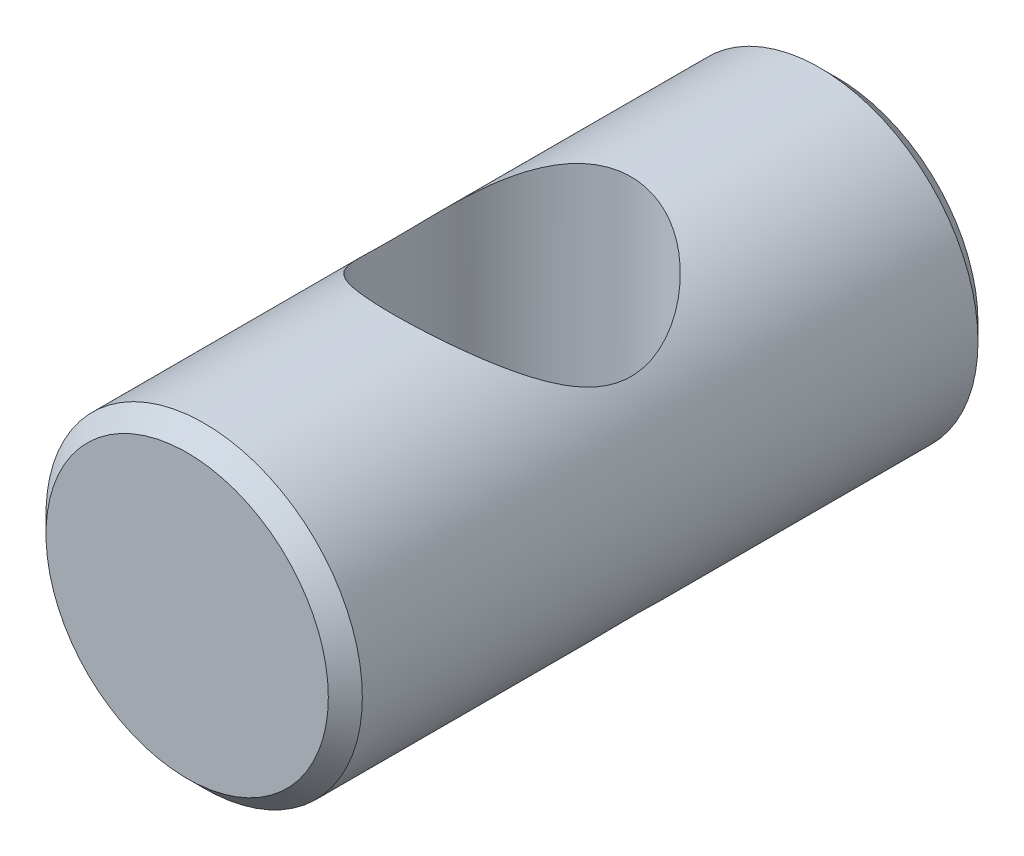
ISO-10303-21;
HEADER;
FILE_DESCRIPTION(('STEP AP214'),'2;1');
FILE_NAME('part.step','',(''),(''),'','','');
FILE_SCHEMA(('AUTOMOTIVE_DESIGN { 1 0 10303 214 1 1 1 1 }'));
ENDSEC;
DATA;
#1=APPLICATION_CONTEXT('core data for automotive mechanical design processes');
#2=APPLICATION_PROTOCOL_DEFINITION('international standard','automotive_design',2000,#1);
#3=PRODUCT_CONTEXT('',#1,'mechanical');
#4=PRODUCT('Part','Part','',(#3));
#5=PRODUCT_RELATED_PRODUCT_CATEGORY('part','',(#4));
#6=PRODUCT_DEFINITION_FORMATION('','',#4);
#7=PRODUCT_DEFINITION_CONTEXT('part definition',#1,'design');
#8=PRODUCT_DEFINITION('design','',#6,#7);
#9=PRODUCT_DEFINITION_SHAPE('','',#8);
#10=(LENGTH_UNIT() NAMED_UNIT(*) SI_UNIT(.MILLI.,.METRE.));
#11=(NAMED_UNIT(*) PLANE_ANGLE_UNIT() SI_UNIT($,.RADIAN.));
#12=(NAMED_UNIT(*) SI_UNIT($,.STERADIAN.) SOLID_ANGLE_UNIT());
#13=UNCERTAINTY_MEASURE_WITH_UNIT(LENGTH_MEASURE(1.E-05),#10,'distance_accuracy_value','');
#14=(GEOMETRIC_REPRESENTATION_CONTEXT(3) GLOBAL_UNCERTAINTY_ASSIGNED_CONTEXT((#13)) GLOBAL_UNIT_ASSIGNED_CONTEXT((#10,
#11,#12)) REPRESENTATION_CONTEXT('',''));
#15=CARTESIAN_POINT('',(0.,0.,0.));
#16=DIRECTION('',(0.,0.,1.));
#17=DIRECTION('',(1.,0.,0.));
#18=AXIS2_PLACEMENT_3D('',#15,#16,#17);
#19=CARTESIAN_POINT('',(0.,0.,19.1));
#20=DIRECTION('',(0.,0.,-1.));
#21=DIRECTION('',(-1.,0.,0.));
#22=AXIS2_PLACEMENT_3D('',#19,#20,#21);
#23=CYLINDRICAL_SURFACE('',#22,4.65);
#24=CARTESIAN_POINT('',(0.,0.,18.6));
#25=DIRECTION('',(0.,0.,1.));
#26=DIRECTION('',(1.,0.,0.));
#27=AXIS2_PLACEMENT_3D('',#24,#25,#26);
#28=CIRCLE('',#27,4.65);
#29=CARTESIAN_POINT('',(4.65,0.,18.6));
#30=VERTEX_POINT('',#29);
#31=EDGE_CURVE('E45',#30,#30,#28,.F.);
#32=ORIENTED_EDGE('',*,*,#31,.T.);
#33=EDGE_LOOP('',(#32));
#34=FACE_BOUND('',#33,.T.);
#35=CARTESIAN_POINT('',(0.,0.,0.5));
#36=DIRECTION('',(0.,0.,1.));
#37=DIRECTION('',(1.,0.,0.));
#38=AXIS2_PLACEMENT_3D('',#35,#36,#37);
#39=CIRCLE('',#38,4.65);
#40=CARTESIAN_POINT('',(4.65,0.,0.5));
#41=VERTEX_POINT('',#40);
#42=EDGE_CURVE('E49',#41,#41,#39,.T.);
#43=ORIENTED_EDGE('',*,*,#42,.T.);
#44=EDGE_LOOP('',(#43));
#45=FACE_BOUND('',#44,.T.);
#46=CARTESIAN_POINT('',(0.,-4.65,13.05));
#47=CARTESIAN_POINT('',(0.0854016520703311,-4.64999924797641,13.0499992235247));
#48=CARTESIAN_POINT('',(0.170820772460458,-4.64764155039145,13.046868532975));
#49=CARTESIAN_POINT('',(0.340982078542111,-4.63826485929958,13.034396241319));
#50=CARTESIAN_POINT('',(0.425723855316022,-4.63124323784305,13.0250511386165));
#51=CARTESIAN_POINT('',(0.593972794169848,-4.61268551408863,13.0002805330556));
#52=CARTESIAN_POINT('',(0.677477460313941,-4.60114131119855,12.9848441194232));
#53=CARTESIAN_POINT('',(0.842499041169359,-4.57380672404709,12.9481399612644));
#54=CARTESIAN_POINT('',(0.924015053679695,-4.55801445022944,12.9268696217053));
#55=CARTESIAN_POINT('',(1.16370699019391,-4.50498217508343,12.8550600056808));
#56=CARTESIAN_POINT('',(1.31824636646825,-4.46194486598266,12.7963365295862));
#57=CARTESIAN_POINT('',(1.6141581522421,-4.36364314274375,12.6598418583226));
#58=CARTESIAN_POINT('',(1.75553392120851,-4.30838186048991,12.5820755415438));
#59=CARTESIAN_POINT('',(2.03617452327363,-4.1835631431914,12.4020697188544));
#60=CARTESIAN_POINT('',(2.17402683593423,-4.11315505194096,12.298229123799));
#61=CARTESIAN_POINT('',(2.43155067797185,-3.96636571364538,12.0732655343126));
#62=CARTESIAN_POINT('',(2.55119381534968,-3.88997541429698,11.9521161104817));
#63=CARTESIAN_POINT('',(2.72764774450201,-3.76682912370311,11.7455333111796));
#64=CARTESIAN_POINT('',(2.79053748708562,-3.72035645513535,11.6650311703144));
#65=CARTESIAN_POINT('',(2.90928327218524,-3.62825180158832,11.4984701911185));
#66=CARTESIAN_POINT('',(2.96513718107307,-3.58262007519036,11.4124096791138));
#67=CARTESIAN_POINT('',(3.06946641956924,-3.49364725923386,11.2349216270663));
#68=CARTESIAN_POINT('',(3.11794894941074,-3.45030396175154,11.1434994467794));
#69=CARTESIAN_POINT('',(3.20716584536629,-3.36753461331458,10.955320793587));
#70=CARTESIAN_POINT('',(3.24790462993505,-3.32810633468572,10.8585674034828));
#71=CARTESIAN_POINT('',(3.33239084091584,-3.24380084370752,10.6290618745588));
#72=CARTESIAN_POINT('',(3.3731890789737,-3.20099524346764,10.4944125229991));
#73=CARTESIAN_POINT('',(3.43867103601174,-3.13055761417712,10.2175930860669));
#74=CARTESIAN_POINT('',(3.46339183829155,-3.10289069069028,10.0754411311908));
#75=CARTESIAN_POINT('',(3.49515402739039,-3.06708827779856,9.78524284859338));
#76=CARTESIAN_POINT('',(3.50203082792384,-3.05913464613785,9.63715435272738));
#77=CARTESIAN_POINT('',(3.49692091629068,-3.06497136828269,9.34170734496946));
#78=CARTESIAN_POINT('',(3.48492805772283,-3.07876880705249,9.19434908662259));
#79=CARTESIAN_POINT('',(3.44553182705256,-3.12274325250207,8.92129196357231));
#80=CARTESIAN_POINT('',(3.41995655829178,-3.15096464488871,8.79498641136952));
#81=CARTESIAN_POINT('',(3.3561516164104,-3.21883582136206,8.54877953933281));
#82=CARTESIAN_POINT('',(3.31790959148239,-3.25849675565921,8.42888460378578));
#83=CARTESIAN_POINT('',(3.23816402522837,-3.33756484308486,8.21786882721835));
#84=CARTESIAN_POINT('',(3.1985604853101,-3.37567166129069,8.12551729213381));
#85=CARTESIAN_POINT('',(3.11228487452168,-3.45537736848747,7.94574850944857));
#86=CARTESIAN_POINT('',(3.06561151078674,-3.49697689557167,7.85833216837297));
#87=CARTESIAN_POINT('',(2.96544018589683,-3.58231794544439,7.68830105028567));
#88=CARTESIAN_POINT('',(2.91192706911211,-3.62606408793213,7.60569754806298));
#89=CARTESIAN_POINT('',(2.79841672511146,-3.71437007838121,7.4456021972158));
#90=CARTESIAN_POINT('',(2.73842052482599,-3.75892979654434,7.36810954214766));
#91=CARTESIAN_POINT('',(2.54559390106465,-3.8945480589704,7.13952341432994));
#92=CARTESIAN_POINT('',(2.40247992184502,-3.9852620474612,6.9966628013183));
#93=CARTESIAN_POINT('',(2.09072691104426,-4.15728622361754,6.73574065304956));
#94=CARTESIAN_POINT('',(1.92213734327171,-4.23861410721272,6.61763209704629));
#95=CARTESIAN_POINT('',(1.5969629783553,-4.36995441557075,6.43111382069489));
#96=CARTESIAN_POINT('',(1.44463176612027,-4.42297856732596,6.35749294705031));
#97=CARTESIAN_POINT('',(1.20660100721624,-4.49148801420559,6.26344904047757));
#98=CARTESIAN_POINT('',(1.12564578552973,-4.51249078976704,6.23482691161757));
#99=CARTESIAN_POINT('',(0.960987127335568,-4.55039854521022,6.18340961636302));
#100=CARTESIAN_POINT('',(0.877284896989406,-4.56730529695629,6.16061193018846));
#101=CARTESIAN_POINT('',(0.707087652364706,-4.596742061478,6.12104780317633));
#102=CARTESIAN_POINT('',(0.620577459830355,-4.60924136964784,6.10432365061272));
#103=CARTESIAN_POINT('',(0.446025230114126,-4.62939265837211,6.07741365535619));
#104=CARTESIAN_POINT('',(0.357983913910202,-4.63704686012168,6.06722481657933));
#105=CARTESIAN_POINT('',(0.181092322222013,-4.64731616693855,6.05356342163948));
#106=CARTESIAN_POINT('',(0.092242148748726,-4.64993189883574,6.0500900300157));
#107=CARTESIAN_POINT('',(-0.0854396468258861,-4.65006561315637,6.04991327544421));
#108=CARTESIAN_POINT('',(-0.174271269850604,-4.64758401307796,6.05320935804115));
#109=CARTESIAN_POINT('',(-0.42135638661445,-4.63358378715703,6.07182781835951));
#110=CARTESIAN_POINT('',(-0.578820653633082,-4.61646084472533,6.09461231990147));
#111=CARTESIAN_POINT('',(-0.886874739489147,-4.56731490653541,6.1605548081492));
#112=CARTESIAN_POINT('',(-1.03746312595522,-4.53528882159135,6.20371701885894));
#113=CARTESIAN_POINT('',(-1.33348786072812,-4.45740909363284,6.3100384261661));
#114=CARTESIAN_POINT('',(-1.47859157242758,-4.41113508335242,6.3738089595028));
#115=CARTESIAN_POINT('',(-1.75598629343727,-4.30824024068527,6.51833263025347));
#116=CARTESIAN_POINT('',(-1.88827549221869,-4.25161794947006,6.59908816233653));
#117=CARTESIAN_POINT('',(-2.15978963005895,-4.12117739340144,6.79006047646928));
#118=CARTESIAN_POINT('',(-2.29650852269048,-4.04606540692058,6.90294337832486));
#119=CARTESIAN_POINT('',(-2.55041625312467,-3.89101971689652,7.14657936713772));
#120=CARTESIAN_POINT('',(-2.66756164412391,-3.81107580951435,7.27737106589645));
#121=CARTESIAN_POINT('',(-2.83812806503433,-3.68427174491269,7.49915896093782));
#122=CARTESIAN_POINT('',(-2.89819721750233,-3.63706993001462,7.58493533348989));
#123=CARTESIAN_POINT('',(-3.01081957508615,-3.54440070944432,7.76226297326184));
#124=CARTESIAN_POINT('',(-3.06337003112606,-3.49893394259403,7.85381633519241));
#125=CARTESIAN_POINT('',(-3.16042743511376,-3.41151793256683,8.04238198834429));
#126=CARTESIAN_POINT('',(-3.20495390035807,-3.36956029100152,8.13938025990128));
#127=CARTESIAN_POINT('',(-3.28554578390605,-3.29102630857392,8.33890010426214));
#128=CARTESIAN_POINT('',(-3.32161420485557,-3.25444805972634,8.44141970102765));
#129=CARTESIAN_POINT('',(-3.39156597114839,-3.18164693467596,8.67519896460729));
#130=CARTESIAN_POINT('',(-3.42316870046283,-3.14732203048745,8.80776975102154));
#131=CARTESIAN_POINT('',(-3.47082173060896,-3.09470454318805,9.07860088840103));
#132=CARTESIAN_POINT('',(-3.48690753328025,-3.076375371966,9.21684749358931));
#133=CARTESIAN_POINT('',(-3.50239705376025,-3.05873845745109,9.49634297392032));
#134=CARTESIAN_POINT('',(-3.50170711949716,-3.05953749875507,9.63760430286767));
#135=CARTESIAN_POINT('',(-3.48347171990874,-3.08027328850059,9.91767221979013));
#136=CARTESIAN_POINT('',(-3.46590562269941,-3.10023346228282,10.0564755912376));
#137=CARTESIAN_POINT('',(-3.41011549835102,-3.16158566193282,10.3554447174187));
#138=CARTESIAN_POINT('',(-3.36841322957349,-3.20651425167389,10.5142048610965));
#139=CARTESIAN_POINT('',(-3.26541977360625,-3.31132737196491,10.820131794007));
#140=CARTESIAN_POINT('',(-3.20407875632249,-3.3712498616577,10.9672678921262));
#141=CARTESIAN_POINT('',(-3.08641722060199,-3.47860806553951,11.2039220785708));
#142=CARTESIAN_POINT('',(-3.03476848905386,-3.52390573117453,11.2968143673636));
#143=CARTESIAN_POINT('',(-2.92376455803738,-3.61653430611696,11.4768600778424));
#144=CARTESIAN_POINT('',(-2.86440685654283,-3.66386587219599,11.5640116224084));
#145=CARTESIAN_POINT('',(-2.73823146939111,-3.75910144518487,11.7324683061781));
#146=CARTESIAN_POINT('',(-2.67141010978111,-3.80700572355758,11.8137705334197));
#147=CARTESIAN_POINT('',(-2.53045552372525,-3.90211834699336,11.9703082375423));
#148=CARTESIAN_POINT('',(-2.45631864276601,-3.94932633054416,12.0455406477511));
#149=CARTESIAN_POINT('',(-2.30013668802652,-4.04230263088691,12.1902293734299));
#150=CARTESIAN_POINT('',(-2.218021401678,-4.08805236644861,12.2596220460165));
#151=CARTESIAN_POINT('',(-2.04670023837652,-4.17645907297562,12.3912471952224));
#152=CARTESIAN_POINT('',(-1.95749558787579,-4.21911657646269,12.4534809057947));
#153=CARTESIAN_POINT('',(-1.77242441706879,-4.30013789980879,12.5700059758156));
#154=CARTESIAN_POINT('',(-1.67657001149188,-4.33850921181738,12.6243112466654));
#155=CARTESIAN_POINT('',(-1.47864210565636,-4.40989844182112,12.7242595081585));
#156=CARTESIAN_POINT('',(-1.37657179434481,-4.44291907356949,12.7699068919169));
#157=CARTESIAN_POINT('',(-1.12313705799933,-4.51495128248563,12.868715892569));
#158=CARTESIAN_POINT('',(-0.968904487870976,-4.55075616931883,12.9171258509482));
#159=CARTESIAN_POINT('',(-0.732002138244281,-4.59272672347974,12.9735633381677));
#160=CARTESIAN_POINT('',(-0.652173931604273,-4.60475592913434,12.9896732768849));
#161=CARTESIAN_POINT('',(-0.49109410260714,-4.62470441378726,13.0163341238132));
#162=CARTESIAN_POINT('',(-0.40984318637817,-4.63262567506109,13.0268877132604));
#163=CARTESIAN_POINT('',(-0.273740370492157,-4.64225715778798,13.0397079829277));
#164=CARTESIAN_POINT('',(-0.219113371747833,-4.64515747479292,13.0435641959887));
#165=CARTESIAN_POINT('',(-0.109660005572927,-4.64902931407424,13.0487106889359));
#166=CARTESIAN_POINT('',(-0.0548336034469108,-4.65000048284972,13.0500004985494));
#167=CARTESIAN_POINT('',(0.,-4.65,13.05));
#168=B_SPLINE_CURVE_WITH_KNOTS('',3,(#46,#47,#48,#49,#50,#51,#52,#53,#54,#55,#56,#57,#58,#59,
#60,#61,#62,#63,#64,#65,#66,#67,#68,#69,#70,#71,#72,#73,#74,#75,#76,#77,#78,#79,#80,#81,#82,#83,
#84,#85,#86,#87,#88,#89,#90,#91,#92,#93,#94,#95,#96,#97,#98,#99,#100,#101,#102,#103,#104,#105,
#106,#107,#108,#109,#110,#111,#112,#113,#114,#115,#116,#117,#118,#119,#120,#121,#122,#123,#124,
#125,#126,#127,#128,#129,#130,#131,#132,#133,#134,#135,#136,#137,#138,#139,#140,#141,#142,#143,
#144,#145,#146,#147,#148,#149,#150,#151,#152,#153,#154,#155,#156,#157,#158,#159,#160,#161,#162,
#163,#164,#165,#166,#167),.UNSPECIFIED.,.T.,.F.,(4,2,2,2,2,2,2,2,2,2,2,2,2,2,2,2,2,2,2,2,2,2,2,
2,2,2,2,2,2,2,2,2,2,2,2,2,2,2,2,2,2,2,2,2,2,2,2,2,2,2,2,2,2,2,2,2,2,2,2,2,4),(0.,
0.25614570708738,0.512435865436232,0.769187190597394,1.02605290899906,1.53610780000847,
2.04603216173227,2.60326167516096,3.1613513185213,3.49772934604484,3.83420913644112,
4.17035811810087,4.50631471907831,4.94591624794246,5.3845001866348,5.82711530754373,
6.26987463102492,6.66422902540834,7.0589691065956,7.38095957831027,7.70300900394737,
8.02578482135152,8.3485095853075,9.01037778880952,9.67097702964188,10.2005228356091,
10.4654357318388,10.7302338262001,10.9968418016532,11.2633274644071,11.5297799718636,
11.7962106563363,12.2738429009336,12.7515741952758,13.245027168369,13.7385497587551,
14.3141572848335,14.8910259709148,15.2352789600097,15.5796574990967,15.9231867311129,
16.2665938233698,16.686575014719,17.10559301792,17.5269507614302,17.9488242905106,
18.4566054475955,18.965685365104,19.3119039309911,19.6582351478434,20.0047376023386,
20.3514140391121,20.7014789057446,21.0514833428206,21.4008660776576,21.7500710544611,
22.2442931451732,22.4910172107838,22.7376221094403,22.9020547496787,23.0665175180978),.UNSPECIFIED.);
#169=CARTESIAN_POINT('',(0.,-4.65,13.05));
#170=VERTEX_POINT('',#169);
#171=EDGE_CURVE('E58',#170,#170,#168,.T.);
#172=ORIENTED_EDGE('',*,*,#171,.T.);
#173=EDGE_LOOP('',(#172));
#174=FACE_BOUND('',#173,.T.);
#175=CARTESIAN_POINT('',(0.,4.65,13.05));
#176=CARTESIAN_POINT('',(-0.0854016520703311,4.64999924797641,13.0499992235247));
#177=CARTESIAN_POINT('',(-0.170820772460458,4.64764155039145,13.046868532975));
#178=CARTESIAN_POINT('',(-0.340982078542111,4.63826485929958,13.034396241319));
#179=CARTESIAN_POINT('',(-0.425723855316022,4.63124323784305,13.0250511386165));
#180=CARTESIAN_POINT('',(-0.593972794169848,4.61268551408863,13.0002805330556));
#181=CARTESIAN_POINT('',(-0.677477460313941,4.60114131119855,12.9848441194232));
#182=CARTESIAN_POINT('',(-0.842499041169359,4.57380672404709,12.9481399612644));
#183=CARTESIAN_POINT('',(-0.924015053679695,4.55801445022944,12.9268696217053));
#184=CARTESIAN_POINT('',(-1.16370699019391,4.50498217508343,12.8550600056808));
#185=CARTESIAN_POINT('',(-1.31824636646825,4.46194486598266,12.7963365295862));
#186=CARTESIAN_POINT('',(-1.6141581522421,4.36364314274375,12.6598418583226));
#187=CARTESIAN_POINT('',(-1.75553392120851,4.30838186048991,12.5820755415438));
#188=CARTESIAN_POINT('',(-2.03617452327363,4.1835631431914,12.4020697188544));
#189=CARTESIAN_POINT('',(-2.17402683593423,4.11315505194096,12.298229123799));
#190=CARTESIAN_POINT('',(-2.43155067797185,3.96636571364538,12.0732655343126));
#191=CARTESIAN_POINT('',(-2.55119381534968,3.88997541429698,11.9521161104817));
#192=CARTESIAN_POINT('',(-2.72764774450201,3.76682912370311,11.7455333111796));
#193=CARTESIAN_POINT('',(-2.79053748708562,3.72035645513535,11.6650311703144));
#194=CARTESIAN_POINT('',(-2.90928327218524,3.62825180158832,11.4984701911185));
#195=CARTESIAN_POINT('',(-2.96513718107307,3.58262007519036,11.4124096791138));
#196=CARTESIAN_POINT('',(-3.06946641956924,3.49364725923386,11.2349216270663));
#197=CARTESIAN_POINT('',(-3.11794894941074,3.45030396175154,11.1434994467794));
#198=CARTESIAN_POINT('',(-3.20716584536629,3.36753461331458,10.955320793587));
#199=CARTESIAN_POINT('',(-3.24790462993505,3.32810633468572,10.8585674034828));
#200=CARTESIAN_POINT('',(-3.33239084091584,3.24380084370752,10.6290618745588));
#201=CARTESIAN_POINT('',(-3.3731890789737,3.20099524346764,10.4944125229991));
#202=CARTESIAN_POINT('',(-3.43867103601174,3.13055761417712,10.2175930860669));
#203=CARTESIAN_POINT('',(-3.46339183829155,3.10289069069028,10.0754411311908));
#204=CARTESIAN_POINT('',(-3.49515402739039,3.06708827779856,9.78524284859338));
#205=CARTESIAN_POINT('',(-3.50203082792384,3.05913464613785,9.63715435272738));
#206=CARTESIAN_POINT('',(-3.49692091629068,3.06497136828269,9.34170734496946));
#207=CARTESIAN_POINT('',(-3.48492805772283,3.07876880705249,9.19434908662259));
#208=CARTESIAN_POINT('',(-3.44553182705256,3.12274325250207,8.92129196357231));
#209=CARTESIAN_POINT('',(-3.41995655829178,3.15096464488871,8.79498641136952));
#210=CARTESIAN_POINT('',(-3.3561516164104,3.21883582136206,8.54877953933281));
#211=CARTESIAN_POINT('',(-3.31790959148239,3.25849675565921,8.42888460378578));
#212=CARTESIAN_POINT('',(-3.23816402522837,3.33756484308486,8.21786882721835));
#213=CARTESIAN_POINT('',(-3.1985604853101,3.37567166129069,8.12551729213381));
#214=CARTESIAN_POINT('',(-3.11228487452168,3.45537736848747,7.94574850944857));
#215=CARTESIAN_POINT('',(-3.06561151078674,3.49697689557167,7.85833216837297));
#216=CARTESIAN_POINT('',(-2.96544018589683,3.58231794544439,7.68830105028567));
#217=CARTESIAN_POINT('',(-2.91192706911211,3.62606408793213,7.60569754806298));
#218=CARTESIAN_POINT('',(-2.79841672511146,3.71437007838121,7.4456021972158));
#219=CARTESIAN_POINT('',(-2.73842052482599,3.75892979654434,7.36810954214766));
#220=CARTESIAN_POINT('',(-2.54559390106465,3.8945480589704,7.13952341432994));
#221=CARTESIAN_POINT('',(-2.40247992184502,3.9852620474612,6.9966628013183));
#222=CARTESIAN_POINT('',(-2.09072691104426,4.15728622361754,6.73574065304956));
#223=CARTESIAN_POINT('',(-1.92213734327171,4.23861410721272,6.61763209704629));
#224=CARTESIAN_POINT('',(-1.5969629783553,4.36995441557075,6.43111382069489));
#225=CARTESIAN_POINT('',(-1.44463176612027,4.42297856732596,6.35749294705031));
#226=CARTESIAN_POINT('',(-1.20660100721624,4.49148801420559,6.26344904047757));
#227=CARTESIAN_POINT('',(-1.12564578552973,4.51249078976704,6.23482691161757));
#228=CARTESIAN_POINT('',(-0.960987127335568,4.55039854521022,6.18340961636302));
#229=CARTESIAN_POINT('',(-0.877284896989406,4.56730529695629,6.16061193018846));
#230=CARTESIAN_POINT('',(-0.707087652364706,4.596742061478,6.12104780317633));
#231=CARTESIAN_POINT('',(-0.620577459830355,4.60924136964784,6.10432365061272));
#232=CARTESIAN_POINT('',(-0.446025230114126,4.62939265837211,6.07741365535619));
#233=CARTESIAN_POINT('',(-0.357983913910202,4.63704686012168,6.06722481657933));
#234=CARTESIAN_POINT('',(-0.181092322222013,4.64731616693855,6.05356342163948));
#235=CARTESIAN_POINT('',(-0.092242148748726,4.64993189883574,6.0500900300157));
#236=CARTESIAN_POINT('',(0.0854396468258861,4.65006561315637,6.04991327544421));
#237=CARTESIAN_POINT('',(0.174271269850604,4.64758401307796,6.05320935804115));
#238=CARTESIAN_POINT('',(0.42135638661445,4.63358378715703,6.07182781835951));
#239=CARTESIAN_POINT('',(0.578820653633082,4.61646084472533,6.09461231990147));
#240=CARTESIAN_POINT('',(0.886874739489147,4.56731490653541,6.1605548081492));
#241=CARTESIAN_POINT('',(1.03746312595522,4.53528882159135,6.20371701885894));
#242=CARTESIAN_POINT('',(1.33348786072812,4.45740909363284,6.3100384261661));
#243=CARTESIAN_POINT('',(1.47859157242758,4.41113508335242,6.3738089595028));
#244=CARTESIAN_POINT('',(1.75598629343727,4.30824024068527,6.51833263025347));
#245=CARTESIAN_POINT('',(1.88827549221869,4.25161794947006,6.59908816233653));
#246=CARTESIAN_POINT('',(2.15978963005895,4.12117739340144,6.79006047646928));
#247=CARTESIAN_POINT('',(2.29650852269048,4.04606540692058,6.90294337832486));
#248=CARTESIAN_POINT('',(2.55041625312467,3.89101971689652,7.14657936713772));
#249=CARTESIAN_POINT('',(2.66756164412391,3.81107580951435,7.27737106589645));
#250=CARTESIAN_POINT('',(2.83812806503433,3.68427174491269,7.49915896093782));
#251=CARTESIAN_POINT('',(2.89819721750233,3.63706993001462,7.58493533348989));
#252=CARTESIAN_POINT('',(3.01081957508615,3.54440070944432,7.76226297326184));
#253=CARTESIAN_POINT('',(3.06337003112606,3.49893394259403,7.85381633519241));
#254=CARTESIAN_POINT('',(3.16042743511376,3.41151793256683,8.04238198834429));
#255=CARTESIAN_POINT('',(3.20495390035807,3.36956029100152,8.13938025990128));
#256=CARTESIAN_POINT('',(3.28554578390605,3.29102630857392,8.33890010426214));
#257=CARTESIAN_POINT('',(3.32161420485557,3.25444805972634,8.44141970102765));
#258=CARTESIAN_POINT('',(3.39156597114839,3.18164693467596,8.67519896460729));
#259=CARTESIAN_POINT('',(3.42316870046283,3.14732203048745,8.80776975102154));
#260=CARTESIAN_POINT('',(3.47082173060896,3.09470454318805,9.07860088840103));
#261=CARTESIAN_POINT('',(3.48690753328025,3.076375371966,9.21684749358931));
#262=CARTESIAN_POINT('',(3.50239705376025,3.05873845745109,9.49634297392032));
#263=CARTESIAN_POINT('',(3.50170711949716,3.05953749875507,9.63760430286767));
#264=CARTESIAN_POINT('',(3.48347171990874,3.08027328850059,9.91767221979013));
#265=CARTESIAN_POINT('',(3.46590562269941,3.10023346228282,10.0564755912376));
#266=CARTESIAN_POINT('',(3.41011549835102,3.16158566193282,10.3554447174187));
#267=CARTESIAN_POINT('',(3.36841322957349,3.20651425167389,10.5142048610965));
#268=CARTESIAN_POINT('',(3.26541977360625,3.31132737196491,10.820131794007));
#269=CARTESIAN_POINT('',(3.20407875632249,3.3712498616577,10.9672678921262));
#270=CARTESIAN_POINT('',(3.08641722060199,3.47860806553951,11.2039220785708));
#271=CARTESIAN_POINT('',(3.03476848905386,3.52390573117453,11.2968143673636));
#272=CARTESIAN_POINT('',(2.92376455803738,3.61653430611696,11.4768600778424));
#273=CARTESIAN_POINT('',(2.86440685654283,3.66386587219599,11.5640116224084));
#274=CARTESIAN_POINT('',(2.73823146939111,3.75910144518487,11.7324683061781));
#275=CARTESIAN_POINT('',(2.67141010978111,3.80700572355758,11.8137705334197));
#276=CARTESIAN_POINT('',(2.53045552372525,3.90211834699336,11.9703082375423));
#277=CARTESIAN_POINT('',(2.45631864276601,3.94932633054416,12.0455406477511));
#278=CARTESIAN_POINT('',(2.30013668802652,4.04230263088691,12.1902293734299));
#279=CARTESIAN_POINT('',(2.218021401678,4.08805236644861,12.2596220460165));
#280=CARTESIAN_POINT('',(2.04670023837652,4.17645907297562,12.3912471952224));
#281=CARTESIAN_POINT('',(1.95749558787579,4.21911657646269,12.4534809057947));
#282=CARTESIAN_POINT('',(1.77242441706879,4.30013789980879,12.5700059758156));
#283=CARTESIAN_POINT('',(1.67657001149188,4.33850921181738,12.6243112466654));
#284=CARTESIAN_POINT('',(1.47864210565636,4.40989844182112,12.7242595081585));
#285=CARTESIAN_POINT('',(1.37657179434481,4.44291907356949,12.7699068919169));
#286=CARTESIAN_POINT('',(1.12313705799933,4.51495128248563,12.868715892569));
#287=CARTESIAN_POINT('',(0.968904487870976,4.55075616931883,12.9171258509482));
#288=CARTESIAN_POINT('',(0.732002138244281,4.59272672347974,12.9735633381677));
#289=CARTESIAN_POINT('',(0.652173931604273,4.60475592913434,12.9896732768849));
#290=CARTESIAN_POINT('',(0.49109410260714,4.62470441378726,13.0163341238132));
#291=CARTESIAN_POINT('',(0.40984318637817,4.63262567506109,13.0268877132604));
#292=CARTESIAN_POINT('',(0.273740370492157,4.64225715778798,13.0397079829277));
#293=CARTESIAN_POINT('',(0.219113371747833,4.64515747479292,13.0435641959887));
#294=CARTESIAN_POINT('',(0.109660005572927,4.64902931407424,13.0487106889359));
#295=CARTESIAN_POINT('',(0.0548336034469108,4.65000048284972,13.0500004985494));
#296=CARTESIAN_POINT('',(0.,4.65,13.05));
#297=B_SPLINE_CURVE_WITH_KNOTS('',3,(#175,#176,#177,#178,#179,#180,#181,#182,#183,#184,#185,
#186,#187,#188,#189,#190,#191,#192,#193,#194,#195,#196,#197,#198,#199,#200,#201,#202,#203,#204,
#205,#206,#207,#208,#209,#210,#211,#212,#213,#214,#215,#216,#217,#218,#219,#220,#221,#222,#223,
#224,#225,#226,#227,#228,#229,#230,#231,#232,#233,#234,#235,#236,#237,#238,#239,#240,#241,#242,
#243,#244,#245,#246,#247,#248,#249,#250,#251,#252,#253,#254,#255,#256,#257,#258,#259,#260,#261,
#262,#263,#264,#265,#266,#267,#268,#269,#270,#271,#272,#273,#274,#275,#276,#277,#278,#279,#280,
#281,#282,#283,#284,#285,#286,#287,#288,#289,#290,#291,#292,#293,#294,#295,#296),.UNSPECIFIED.,
.T.,.F.,(4,2,2,2,2,2,2,2,2,2,2,2,2,2,2,2,2,2,2,2,2,2,2,2,2,2,2,2,2,2,2,2,2,2,2,2,2,2,2,2,2,2,2,
2,2,2,2,2,2,2,2,2,2,2,2,2,2,2,2,2,4),(0.,0.25614570708738,0.512435865436232,0.769187190597394,
1.02605290899906,1.53610780000847,2.04603216173227,2.60326167516096,3.1613513185213,
3.49772934604484,3.83420913644112,4.17035811810087,4.50631471907831,4.94591624794246,
5.3845001866348,5.82711530754373,6.26987463102492,6.66422902540834,7.0589691065956,
7.38095957831027,7.70300900394737,8.02578482135152,8.3485095853075,9.01037778880952,
9.67097702964188,10.2005228356091,10.4654357318388,10.7302338262001,10.9968418016532,
11.2633274644071,11.5297799718636,11.7962106563363,12.2738429009336,12.7515741952758,
13.245027168369,13.7385497587551,14.3141572848335,14.8910259709148,15.2352789600097,
15.5796574990967,15.9231867311129,16.2665938233698,16.686575014719,17.10559301792,
17.5269507614302,17.9488242905106,18.4566054475955,18.965685365104,19.3119039309911,
19.6582351478434,20.0047376023386,20.3514140391121,20.7014789057446,21.0514833428206,
21.4008660776576,21.7500710544611,22.2442931451732,22.4910172107838,22.7376221094403,
22.9020547496787,23.0665175180978),.UNSPECIFIED.);
#298=CARTESIAN_POINT('',(0.,4.65,13.05));
#299=VERTEX_POINT('',#298);
#300=EDGE_CURVE('E66',#299,#299,#297,.T.);
#301=ORIENTED_EDGE('',*,*,#300,.T.);
#302=EDGE_LOOP('',(#301));
#303=FACE_BOUND('',#302,.T.);
#304=ADVANCED_FACE('F37',(#34,#45,#174,#303),#23,.T.);
#305=CARTESIAN_POINT('',(0.,0.,19.1));
#306=DIRECTION('',(0.,0.,1.));
#307=DIRECTION('',(1.,0.,0.));
#308=AXIS2_PLACEMENT_3D('',#305,#306,#307);
#309=PLANE('',#308);
#310=CARTESIAN_POINT('',(0.,0.,19.1));
#311=DIRECTION('',(0.,0.,1.));
#312=DIRECTION('',(1.,0.,0.));
#313=AXIS2_PLACEMENT_3D('',#310,#311,#312);
#314=CIRCLE('',#313,4.15);
#315=CARTESIAN_POINT('',(4.15,0.,19.1));
#316=VERTEX_POINT('',#315);
#317=EDGE_CURVE('E53',#316,#316,#314,.T.);
#318=ORIENTED_EDGE('',*,*,#317,.T.);
#319=EDGE_LOOP('',(#318));
#320=FACE_BOUND('',#319,.T.);
#321=ADVANCED_FACE('F79',(#320),#309,.T.);
#322=CARTESIAN_POINT('',(0.,0.,0.));
#323=DIRECTION('',(0.,0.,1.));
#324=DIRECTION('',(1.,0.,0.));
#325=AXIS2_PLACEMENT_3D('',#322,#323,#324);
#326=PLANE('',#325);
#327=CARTESIAN_POINT('',(0.,0.,0.));
#328=DIRECTION('',(0.,0.,1.));
#329=DIRECTION('',(1.,0.,0.));
#330=AXIS2_PLACEMENT_3D('',#327,#328,#329);
#331=CIRCLE('',#330,4.15);
#332=CARTESIAN_POINT('',(4.15,0.,0.));
#333=VERTEX_POINT('',#332);
#334=EDGE_CURVE('E10',#333,#333,#331,.F.);
#335=ORIENTED_EDGE('',*,*,#334,.T.);
#336=EDGE_LOOP('',(#335));
#337=FACE_BOUND('',#336,.T.);
#338=ADVANCED_FACE('F77',(#337),#326,.F.);
#339=CARTESIAN_POINT('',(0.,-4.65,9.55));
#340=DIRECTION('',(0.,1.,0.));
#341=DIRECTION('',(0.,0.,1.));
#342=AXIS2_PLACEMENT_3D('',#339,#340,#341);
#343=CYLINDRICAL_SURFACE('',#342,3.5);
#344=ORIENTED_EDGE('',*,*,#300,.F.);
#345=EDGE_LOOP('',(#344));
#346=FACE_BOUND('',#345,.T.);
#347=ORIENTED_EDGE('',*,*,#171,.F.);
#348=EDGE_LOOP('',(#347));
#349=FACE_BOUND('',#348,.T.);
#350=ADVANCED_FACE('F72',(#346,#349),#343,.F.);
#351=CARTESIAN_POINT('',(0.,0.,19.1));
#352=DIRECTION('',(0.,0.,-1.));
#353=DIRECTION('',(-1.,0.,0.));
#354=AXIS2_PLACEMENT_3D('',#351,#352,#353);
#355=CONICAL_SURFACE('',#354,4.15,0.785398163397448);
#356=ORIENTED_EDGE('',*,*,#31,.F.);
#357=EDGE_LOOP('',(#356));
#358=FACE_BOUND('',#357,.T.);
#359=ORIENTED_EDGE('',*,*,#317,.F.);
#360=EDGE_LOOP('',(#359));
#361=FACE_BOUND('',#360,.T.);
#362=ADVANCED_FACE('F76',(#358,#361),#355,.T.);
#363=CARTESIAN_POINT('',(0.,0.,0.5));
#364=DIRECTION('',(0.,0.,1.));
#365=DIRECTION('',(1.,0.,0.));
#366=AXIS2_PLACEMENT_3D('',#363,#364,#365);
#367=CONICAL_SURFACE('',#366,4.65,0.785398163397452);
#368=ORIENTED_EDGE('',*,*,#334,.F.);
#369=EDGE_LOOP('',(#368));
#370=FACE_BOUND('',#369,.T.);
#371=ORIENTED_EDGE('',*,*,#42,.F.);
#372=EDGE_LOOP('',(#371));
#373=FACE_BOUND('',#372,.T.);
#374=ADVANCED_FACE('F40',(#370,#373),#367,.T.);
#375=CLOSED_SHELL('',(#304,#321,#338,#350,#362,#374));
#376=MANIFOLD_SOLID_BREP('B2',#375);
#377=ADVANCED_BREP_SHAPE_REPRESENTATION('',(#18,#376),#14);
#378=SHAPE_DEFINITION_REPRESENTATION(#9,#377);
ENDSEC;
END-ISO-10303-21;
